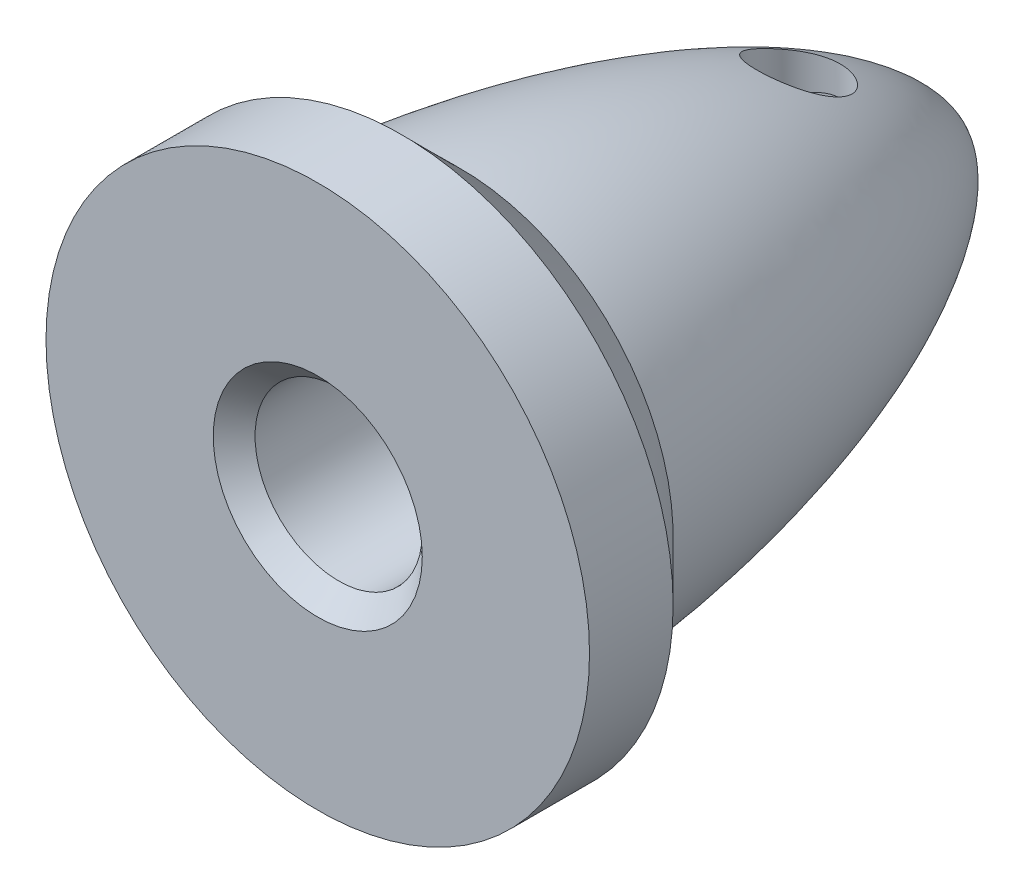
ISO-10303-21;
HEADER;
FILE_DESCRIPTION(('STEP AP214'),'2;1');
FILE_NAME('part.step','',(''),(''),'','','');
FILE_SCHEMA(('AUTOMOTIVE_DESIGN { 1 0 10303 214 1 1 1 1 }'));
ENDSEC;
DATA;
#1=APPLICATION_CONTEXT('core data for automotive mechanical design processes');
#2=APPLICATION_PROTOCOL_DEFINITION('international standard','automotive_design',2000,#1);
#3=PRODUCT_CONTEXT('',#1,'mechanical');
#4=PRODUCT('Part','Part','',(#3));
#5=PRODUCT_RELATED_PRODUCT_CATEGORY('part','',(#4));
#6=PRODUCT_DEFINITION_FORMATION('','',#4);
#7=PRODUCT_DEFINITION_CONTEXT('part definition',#1,'design');
#8=PRODUCT_DEFINITION('design','',#6,#7);
#9=PRODUCT_DEFINITION_SHAPE('','',#8);
#10=(LENGTH_UNIT() NAMED_UNIT(*) SI_UNIT(.MILLI.,.METRE.));
#11=(NAMED_UNIT(*) PLANE_ANGLE_UNIT() SI_UNIT($,.RADIAN.));
#12=(NAMED_UNIT(*) SI_UNIT($,.STERADIAN.) SOLID_ANGLE_UNIT());
#13=UNCERTAINTY_MEASURE_WITH_UNIT(LENGTH_MEASURE(1.E-05),#10,'distance_accuracy_value','');
#14=(GEOMETRIC_REPRESENTATION_CONTEXT(3) GLOBAL_UNCERTAINTY_ASSIGNED_CONTEXT((#13)) GLOBAL_UNIT_ASSIGNED_CONTEXT((#10,
#11,#12)) REPRESENTATION_CONTEXT('',''));
#15=CARTESIAN_POINT('',(0.,0.,0.));
#16=DIRECTION('',(0.,0.,1.));
#17=DIRECTION('',(1.,0.,0.));
#18=AXIS2_PLACEMENT_3D('',#15,#16,#17);
#19=CARTESIAN_POINT('',(0.,-5.,-3.9));
#20=DIRECTION('',(0.,1.,0.));
#21=DIRECTION('',(0.,0.,1.));
#22=AXIS2_PLACEMENT_3D('',#19,#20,#21);
#23=CYLINDRICAL_SURFACE('',#22,0.997568670242186);
#24=CARTESIAN_POINT('',(0.,-2.,-2.90243132975781));
#25=CARTESIAN_POINT('',(0.0524594250103676,-1.99999715271156,-2.90243461416244));
#26=CARTESIAN_POINT('',(0.104981846497094,-1.99791384646165,-2.90659369377345));
#27=CARTESIAN_POINT('',(0.20847533307653,-1.98978531965486,-2.92304653254191));
#28=CARTESIAN_POINT('',(0.259443237930466,-1.98373252693781,-2.93535583943934));
#29=CARTESIAN_POINT('',(0.358172416511937,-1.9682987149076,-2.96750843734887));
#30=CARTESIAN_POINT('',(0.4059452962657,-1.95893061813594,-2.98732249677558));
#31=CARTESIAN_POINT('',(0.497418221518089,-1.93772619949191,-3.03377127700513));
#32=CARTESIAN_POINT('',(0.541118600651973,-1.92589008006731,-3.06040543840724));
#33=CARTESIAN_POINT('',(0.626169972808149,-1.9000012103805,-3.12156495196883));
#34=CARTESIAN_POINT('',(0.667220478988625,-1.88585784272592,-3.15646924980397));
#35=CARTESIAN_POINT('',(0.743161532277854,-1.85724549371793,-3.23236258377246));
#36=CARTESIAN_POINT('',(0.778047409811758,-1.84277627481291,-3.27335618953303));
#37=CARTESIAN_POINT('',(0.843364564321497,-1.81386566917252,-3.36405479673393));
#38=CARTESIAN_POINT('',(0.873245243101548,-1.7995123870187,-3.41418770866831));
#39=CARTESIAN_POINT('',(0.924024628192724,-1.77397624500991,-3.51955942659967));
#40=CARTESIAN_POINT('',(0.944929727889453,-1.76279113037973,-3.57479456404264));
#41=CARTESIAN_POINT('',(0.975808453079659,-1.74587891368218,-3.68543636286623));
#42=CARTESIAN_POINT('',(0.986360516261811,-1.7398656686493,-3.74063565135518));
#43=CARTESIAN_POINT('',(0.998004945436978,-1.73321562954956,-3.85232151391752));
#44=CARTESIAN_POINT('',(0.999106577763639,-1.7325735689459,-3.9088067725558));
#45=CARTESIAN_POINT('',(0.992243397125365,-1.73650805246481,-4.01424319624312));
#46=CARTESIAN_POINT('',(0.985340655259159,-1.74047338582849,-4.0632918589373));
#47=CARTESIAN_POINT('',(0.964503786092984,-1.75210541211421,-4.159413313155));
#48=CARTESIAN_POINT('',(0.950567437155512,-1.75977327448518,-4.20648547528862));
#49=CARTESIAN_POINT('',(0.915804095219781,-1.77811555449783,-4.29866110208399));
#50=CARTESIAN_POINT('',(0.894824107709973,-1.78885586564109,-4.3436931354802));
#51=CARTESIAN_POINT('',(0.846686198043406,-1.81213592195457,-4.42981334345203));
#52=CARTESIAN_POINT('',(0.819525501862759,-1.82467647417265,-4.47089973533549));
#53=CARTESIAN_POINT('',(0.755802970435087,-1.85205530562868,-4.55341692222674));
#54=CARTESIAN_POINT('',(0.718487540091775,-1.86698391849506,-4.59423782550359));
#55=CARTESIAN_POINT('',(0.637478055024337,-1.89617397171442,-4.66929567711961));
#56=CARTESIAN_POINT('',(0.593780997297962,-1.91043509377116,-4.70352950810638));
#57=CARTESIAN_POINT('',(0.49870089967466,-1.93748485064028,-4.76592027816102));
#58=CARTESIAN_POINT('',(0.447056752108998,-1.95017556275888,-4.79372520249353));
#59=CARTESIAN_POINT('',(0.339030490902014,-1.97182225232422,-4.84002501618078));
#60=CARTESIAN_POINT('',(0.282652163496134,-1.98078118077765,-4.85852726427945));
#61=CARTESIAN_POINT('',(0.171748595746771,-1.99332786831197,-4.88418136876396));
#62=CARTESIAN_POINT('',(0.117454606675548,-1.99729798419788,-4.89214415348592));
#63=CARTESIAN_POINT('',(0.00816387715475017,-2.00072902939577,-4.89903464496295));
#64=CARTESIAN_POINT('',(-0.0468325206336346,-2.00019207938678,-4.89796660093067));
#65=CARTESIAN_POINT('',(-0.151461840832209,-1.99489189545261,-4.88729648041862));
#66=CARTESIAN_POINT('',(-0.201181530258334,-1.990457472657,-4.8783582680615));
#67=CARTESIAN_POINT('',(-0.298315888898359,-1.97823278089969,-4.85324089736304));
#68=CARTESIAN_POINT('',(-0.345730302797626,-1.97044214116707,-4.83706093899754));
#69=CARTESIAN_POINT('',(-0.438483036742815,-1.95193103576922,-4.79749202010232));
#70=CARTESIAN_POINT('',(-0.483722743876432,-1.9411329145026,-4.77390952220291));
#71=CARTESIAN_POINT('',(-0.569752888069975,-1.91764786388476,-4.72042282494501));
#72=CARTESIAN_POINT('',(-0.610541414463013,-1.90496012890077,-4.69051592689709));
#73=CARTESIAN_POINT('',(-0.690742536895142,-1.87745650897909,-4.62185218432758));
#74=CARTESIAN_POINT('',(-0.729630098196528,-1.86255385973273,-4.58251576298063));
#75=CARTESIAN_POINT('',(-0.800487709667603,-1.83321933465918,-4.4978406344844));
#76=CARTESIAN_POINT('',(-0.832453032018503,-1.81878778626663,-4.45249785890946));
#77=CARTESIAN_POINT('',(-0.889994104757553,-1.79136155315756,-4.35435650022342));
#78=CARTESIAN_POINT('',(-0.915191481843803,-1.7784684992907,-4.30130515822179));
#79=CARTESIAN_POINT('',(-0.956030922960774,-1.75685704463733,-4.19086515614207));
#80=CARTESIAN_POINT('',(-0.97168524068135,-1.74813329341502,-4.1334821649987));
#81=CARTESIAN_POINT('',(-0.991555618527273,-1.73693290429999,-4.02189201951826));
#82=CARTESIAN_POINT('',(-0.996724150137182,-1.73393766331855,-3.96790759050887));
#83=CARTESIAN_POINT('',(-0.998220994385258,-1.73307746049196,-3.85978501959308));
#84=CARTESIAN_POINT('',(-0.994553077252192,-1.73521031065431,-3.80564695308354));
#85=CARTESIAN_POINT('',(-0.979370449400182,-1.74381655561492,-3.70413991368175));
#86=CARTESIAN_POINT('',(-0.968628985561215,-1.74986129447821,-3.65661431079531));
#87=CARTESIAN_POINT('',(-0.940556813272735,-1.76510806310184,-3.56409077830567));
#88=CARTESIAN_POINT('',(-0.923223993230456,-1.77431110455697,-3.51909366403131));
#89=CARTESIAN_POINT('',(-0.881156555592799,-1.79559265748582,-3.42955779244733));
#90=CARTESIAN_POINT('',(-0.856002764265179,-1.80782285567664,-3.38525309444835));
#91=CARTESIAN_POINT('',(-0.799471838366293,-1.83352357657163,-3.30120442768342));
#92=CARTESIAN_POINT('',(-0.768091474771697,-1.84699474087539,-3.26146284224358));
#93=CARTESIAN_POINT('',(-0.695555903638532,-1.87560589844456,-3.18268087479494));
#94=CARTESIAN_POINT('',(-0.653678039863141,-1.89075106694038,-3.14430408929242));
#95=CARTESIAN_POINT('',(-0.563652567139212,-1.91951220435717,-3.07497480960564));
#96=CARTESIAN_POINT('',(-0.515501619327505,-1.93312735168141,-3.04402629424739));
#97=CARTESIAN_POINT('',(-0.41367088241952,-1.9574559681332,-2.99041101703909));
#98=CARTESIAN_POINT('',(-0.359957002690006,-1.96814988328437,-2.96779972651099));
#99=CARTESIAN_POINT('',(-0.248865292955901,-1.98524556090505,-2.93222434836852));
#100=CARTESIAN_POINT('',(-0.191498408012464,-1.99165954001506,-2.91923279046701));
#101=CARTESIAN_POINT('',(-0.111288392085542,-1.99702534810346,-2.90840654931715));
#102=CARTESIAN_POINT('',(-0.0891086000571398,-1.99813795766139,-2.90616898337109));
#103=CARTESIAN_POINT('',(-0.0446230080425255,-1.99962589942108,-2.90318065446548));
#104=CARTESIAN_POINT('',(-0.0223172045980532,-2.00000121128889,-2.90242993251166));
#105=CARTESIAN_POINT('',(0.,-2.,-2.90243132975781));
#106=B_SPLINE_CURVE_WITH_KNOTS('',3,(#24,#25,#26,#27,#28,#29,#30,#31,#32,#33,#34,#35,#36,#37,
#38,#39,#40,#41,#42,#43,#44,#45,#46,#47,#48,#49,#50,#51,#52,#53,#54,#55,#56,#57,#58,#59,#60,#61,
#62,#63,#64,#65,#66,#67,#68,#69,#70,#71,#72,#73,#74,#75,#76,#77,#78,#79,#80,#81,#82,#83,#84,#85,
#86,#87,#88,#89,#90,#91,#92,#93,#94,#95,#96,#97,#98,#99,#100,#101,#102,#103,#104,#105),
.UNSPECIFIED.,.T.,.F.,(4,2,2,2,2,2,2,2,2,2,2,2,2,2,2,2,2,2,2,2,2,2,2,2,2,2,2,2,2,2,2,2,2,2,2,2,
2,2,2,2,4),(0.,0.157287695322589,0.314876307548981,0.471857309339841,0.628825439303562,
0.795257106534248,0.961814306785799,1.14120921429041,1.32047612433182,1.4890336514275,
1.65742588563349,1.80580307736868,1.95422716493226,2.10610973372331,2.25806060532531,
2.42917244572679,2.60036506723189,2.77943327147504,2.9583596027345,3.12251476479556,
3.28659269237707,3.43802886338051,3.58948176826449,3.74528055828942,3.90114596396449,
4.07226055446166,4.24349164844425,4.4229060679713,4.60208962390087,4.76409983349614,
4.92604093078355,5.07269813692586,5.2194023654903,5.37596642495026,5.5326118897992,
5.70816425474045,5.88381044250717,6.06060505174886,6.2368928351642,6.30380406936197,
6.37071714888156),.UNSPECIFIED.);
#107=CARTESIAN_POINT('',(0.,-2.,-2.90243132975781));
#108=VERTEX_POINT('',#107);
#109=EDGE_CURVE('E101',#108,#108,#106,.T.);
#110=ORIENTED_EDGE('',*,*,#109,.T.);
#111=EDGE_LOOP('',(#110));
#112=FACE_BOUND('',#111,.T.);
#113=CARTESIAN_POINT('',(1.06468653338077E-13,-3.58282475890323,-2.90243132975764));
#114=CARTESIAN_POINT('',(-0.0499231173740659,-3.58282389738684,-2.90243245712086));
#115=CARTESIAN_POINT('',(-0.0998554337525465,-3.580397203753,-2.90619925757935));
#116=CARTESIAN_POINT('',(-0.198163222545221,-3.57086699546815,-2.92104685749568));
#117=CARTESIAN_POINT('',(-0.246537987235049,-3.56376138539764,-2.93213093394929));
#118=CARTESIAN_POINT('',(-0.340158759188664,-3.54540219146496,-2.96094484845661));
#119=CARTESIAN_POINT('',(-0.385418011384299,-3.53416764454145,-2.97864419231534));
#120=CARTESIAN_POINT('',(-0.472146430271123,-3.50818427726644,-3.01992408523352));
#121=CARTESIAN_POINT('',(-0.513608951743976,-3.49342945231644,-3.04351468635832));
#122=CARTESIAN_POINT('',(-0.59464742281207,-3.4600474068558,-3.0974642714262));
#123=CARTESIAN_POINT('',(-0.633911013826299,-3.44122701278957,-3.12817075784944));
#124=CARTESIAN_POINT('',(-0.706828013724319,-3.40125119064826,-3.19433410854948));
#125=CARTESIAN_POINT('',(-0.740479127150034,-3.38009481302547,-3.22979290584195));
#126=CARTESIAN_POINT('',(-0.806596675956152,-3.33284477365775,-3.31037203075725));
#127=CARTESIAN_POINT('',(-0.838089406126025,-3.30649159027203,-3.35614002442536));
#128=CARTESIAN_POINT('',(-0.892912382817367,-3.25275722329869,-3.45178849715272));
#129=CARTESIAN_POINT('',(-0.916237390972063,-3.22537539240607,-3.5016715901864));
#130=CARTESIAN_POINT('',(-0.956617787861717,-3.16736469538357,-3.61055898432707));
#131=CARTESIAN_POINT('',(-0.972629961853218,-3.13672817610381,-3.66994968119578));
#132=CARTESIAN_POINT('',(-0.993535409728305,-3.07665909597668,-3.79127791884639));
#133=CARTESIAN_POINT('',(-0.998425835420053,-3.04722684542763,-3.85321610788733));
#134=CARTESIAN_POINT('',(-0.996460473664671,-2.99062673503494,-3.97843408769578));
#135=CARTESIAN_POINT('',(-0.989533335491946,-2.96347367583267,-4.04171973342983));
#136=CARTESIAN_POINT('',(-0.963256350802135,-2.9128078572598,-4.16716345791828));
#137=CARTESIAN_POINT('',(-0.9439173038151,-2.88929195527253,-4.22932246865287));
#138=CARTESIAN_POINT('',(-0.895232016751631,-2.84882209827897,-4.34407458721339));
#139=CARTESIAN_POINT('',(-0.867040334153196,-2.83145262006946,-4.39701038836146));
#140=CARTESIAN_POINT('',(-0.800941100070784,-2.80065601487977,-4.49770918775916));
#141=CARTESIAN_POINT('',(-0.763039350585314,-2.7872265438946,-4.5454752508909));
#142=CARTESIAN_POINT('',(-0.682558280911839,-2.76524243601699,-4.62960733176164));
#143=CARTESIAN_POINT('',(-0.640745145595051,-2.75634991204458,-4.66662114089325));
#144=CARTESIAN_POINT('',(-0.551202054372667,-2.74132394769611,-4.73332725840126));
#145=CARTESIAN_POINT('',(-0.503472895288707,-2.7351901362666,-4.76302055116178));
#146=CARTESIAN_POINT('',(-0.404843998141331,-2.72534660922652,-4.81336215646564));
#147=CARTESIAN_POINT('',(-0.354061208343609,-2.72157718001246,-4.83422853473058));
#148=CARTESIAN_POINT('',(-0.249671158864457,-2.71580342760696,-4.86737085425217));
#149=CARTESIAN_POINT('',(-0.196063889569409,-2.71379911042381,-4.8796467662676));
#150=CARTESIAN_POINT('',(-0.0871986642467561,-2.7112738895278,-4.8952799274579));
#151=CARTESIAN_POINT('',(-0.0319326759746479,-2.7107620454948,-4.8985826992373));
#152=CARTESIAN_POINT('',(0.0783823673109298,-2.71116819175905,-4.89601385986357));
#153=CARTESIAN_POINT('',(0.133431413428654,-2.71208624009005,-4.89014187634286));
#154=CARTESIAN_POINT('',(0.241972141754791,-2.71549844250584,-4.86935939246573));
#155=CARTESIAN_POINT('',(0.295456869893833,-2.71799876341883,-4.85441353644796));
#156=CARTESIAN_POINT('',(0.39910494524898,-2.72491162969959,-4.81592250084443));
#157=CARTESIAN_POINT('',(0.449268469444906,-2.72932407307978,-4.79237777991009));
#158=CARTESIAN_POINT('',(0.544610709514551,-2.74047553100574,-4.73758674264088));
#159=CARTESIAN_POINT('',(0.589810800477652,-2.74720400789032,-4.70637548916394));
#160=CARTESIAN_POINT('',(0.674201221991998,-2.76341324285525,-4.63727169027225));
#161=CARTESIAN_POINT('',(0.713392388812106,-2.77289361741855,-4.59938007615184));
#162=CARTESIAN_POINT('',(0.784548069031865,-2.79482689410507,-4.51847707779455));
#163=CARTESIAN_POINT('',(0.816551860057461,-2.80726283580421,-4.47549558310297));
#164=CARTESIAN_POINT('',(0.872948868144541,-2.83518084631849,-4.38571141700376));
#165=CARTESIAN_POINT('',(0.897341370867181,-2.85066320082503,-4.3389083874551));
#166=CARTESIAN_POINT('',(0.938743821936914,-2.88490392425152,-4.24171061673953));
#167=CARTESIAN_POINT('',(0.955546849644156,-2.90373657003319,-4.19125433425663));
#168=CARTESIAN_POINT('',(0.980853712563348,-2.94394083460608,-4.08929313708715));
#169=CARTESIAN_POINT('',(0.989354615113955,-2.96531334759756,-4.0377878584046));
#170=CARTESIAN_POINT('',(0.998663471474733,-3.01186011672667,-3.93066232319129));
#171=CARTESIAN_POINT('',(0.998774521715492,-3.03720267744581,-3.87505525867204));
#172=CARTESIAN_POINT('',(0.989960873197463,-3.08933426106788,-3.76524332672793));
#173=CARTESIAN_POINT('',(0.981030428832837,-3.11612419348584,-3.71103937340165));
#174=CARTESIAN_POINT('',(0.953164973066095,-3.17307143994346,-3.59958038105514));
#175=CARTESIAN_POINT('',(0.933290247250398,-3.20329032239285,-3.54259010770034));
#176=CARTESIAN_POINT('',(0.883473915900581,-3.26319723477082,-3.4328245505961));
#177=CARTESIAN_POINT('',(0.853524746444596,-3.29288484812992,-3.38005247083276));
#178=CARTESIAN_POINT('',(0.782724332203025,-3.35140046227825,-3.2783404878894));
#179=CARTESIAN_POINT('',(0.741524970925017,-3.38016092581745,-3.22960212932498));
#180=CARTESIAN_POINT('',(0.649328290158312,-3.43396516400959,-3.13997826335203));
#181=CARTESIAN_POINT('',(0.59834590201953,-3.45901450083061,-3.09908097626721));
#182=CARTESIAN_POINT('',(0.501470902634161,-3.49797709898698,-3.03621375038132));
#183=CARTESIAN_POINT('',(0.457474058863277,-3.51311001632547,-3.0120667283537));
#184=CARTESIAN_POINT('',(0.36536672867193,-3.53940026612119,-2.97037830271318));
#185=CARTESIAN_POINT('',(0.317261447741135,-3.55056253946485,-2.95282868803388));
#186=CARTESIAN_POINT('',(0.224593815704602,-3.56704008909386,-2.92701238952466));
#187=CARTESIAN_POINT('',(0.180386528710261,-3.57292770589227,-2.91783411336455));
#188=CARTESIAN_POINT('',(0.0907886489830712,-3.58082031509142,-2.90554325433268));
#189=CARTESIAN_POINT('',(0.04539812799074,-3.5828255423325,-2.90243030457767));
#190=CARTESIAN_POINT('',(1.06468653338077E-13,-3.58282475890323,-2.90243132975764));
#191=B_SPLINE_CURVE_WITH_KNOTS('',3,(#113,#114,#115,#116,#117,#118,#119,#120,#121,#122,#123,
#124,#125,#126,#127,#128,#129,#130,#131,#132,#133,#134,#135,#136,#137,#138,#139,#140,#141,#142,
#143,#144,#145,#146,#147,#148,#149,#150,#151,#152,#153,#154,#155,#156,#157,#158,#159,#160,#161,
#162,#163,#164,#165,#166,#167,#168,#169,#170,#171,#172,#173,#174,#175,#176,#177,#178,#179,#180,
#181,#182,#183,#184,#185,#186,#187,#188,#189,#190),.UNSPECIFIED.,.T.,.F.,(4,2,2,2,2,2,2,2,2,2,2,
2,2,2,2,2,2,2,2,2,2,2,2,2,2,2,2,2,2,2,2,2,2,2,2,2,2,2,4),(0.,0.149590891646238,
0.299248822115795,0.448225220908287,0.597457571260476,0.756685140237273,0.915977673153277,
1.09970723634143,1.28355441955071,1.48876056338211,1.69401925297021,1.90052162035303,
2.10684455436017,2.29312569795927,2.47929579265137,2.6480988007921,2.81687909772814,
2.98120419793327,3.14552985748415,3.31085095870883,3.47617876984724,3.6421549400653,
3.80812225863944,3.97334421551919,4.13854315735717,4.30281607480959,4.46710440506084,
4.63563544467671,4.80422599506598,4.9868063409,5.1695027840828,5.37110622319253,
5.57286136585846,5.78175207349479,5.99032646156697,6.14694360967845,6.30336518321045,
6.43940551136134,6.57543761036448),.UNSPECIFIED.);
#192=CARTESIAN_POINT('',(1.06468653338077E-13,-3.58282475890323,-2.90243132975764));
#193=VERTEX_POINT('',#192);
#194=EDGE_CURVE('E87',#193,#193,#191,.T.);
#195=ORIENTED_EDGE('',*,*,#194,.T.);
#196=EDGE_LOOP('',(#195));
#197=FACE_BOUND('',#196,.T.);
#198=ADVANCED_FACE('F40',(#112,#197),#23,.F.);
#199=CARTESIAN_POINT('',(0.,0.,-7.6));
#200=CARTESIAN_POINT('',(-1.97174268393665,0.,-7.41138074985025));
#201=CARTESIAN_POINT('',(-4.45743913995399,0.,-2.68629920780597));
#202=CARTESIAN_POINT('',(-5.0857864376269,0.,4.18578643762691));
#203=B_SPLINE_CURVE_WITH_KNOTS('',3,(#199,#200,#201,#202),.UNSPECIFIED.,.F.,.F.,(4,4),(0.,1.),.UNSPECIFIED.);
#204=CARTESIAN_POINT('',(0.,0.,-14.3448275862069));
#205=DIRECTION('',(0.,0.,-1.));
#206=AXIS1_PLACEMENT('',#204,#205);
#207=SURFACE_OF_REVOLUTION('',#203,#206);
#208=ORIENTED_EDGE('',*,*,#194,.F.);
#209=EDGE_LOOP('',(#208));
#210=FACE_BOUND('',#209,.T.);
#211=CARTESIAN_POINT('',(0.,3.58282475890321,-2.90243132975766));
#212=CARTESIAN_POINT('',(0.0499231173742492,3.58282389738681,-2.90243245712089));
#213=CARTESIAN_POINT('',(0.0998554337527351,3.58039720375298,-2.90619925757937));
#214=CARTESIAN_POINT('',(0.198163222545414,3.57086699546813,-2.92104685749571));
#215=CARTESIAN_POINT('',(0.246537987235242,3.56376138539761,-2.93213093394934));
#216=CARTESIAN_POINT('',(0.340158759188858,3.54540219146492,-2.96094484845669));
#217=CARTESIAN_POINT('',(0.385418011384493,3.5341676445414,-2.97864419231542));
#218=CARTESIAN_POINT('',(0.472146430271314,3.50818427726637,-3.01992408523362));
#219=CARTESIAN_POINT('',(0.513608951744164,3.49342945231637,-3.04351468635843));
#220=CARTESIAN_POINT('',(0.594647422812251,3.46004740685572,-3.09746427142633));
#221=CARTESIAN_POINT('',(0.633911013826476,3.44122701278949,-3.12817075784959));
#222=CARTESIAN_POINT('',(0.706828013724486,3.40125119064816,-3.19433410854965));
#223=CARTESIAN_POINT('',(0.740479127150196,3.38009481302536,-3.22979290584213));
#224=CARTESIAN_POINT('',(0.8065966759563,3.33284477365763,-3.31037203075745));
#225=CARTESIAN_POINT('',(0.838089406126164,3.30649159027191,-3.35614002442557));
#226=CARTESIAN_POINT('',(0.892912382817485,3.25275722329856,-3.45178849715295));
#227=CARTESIAN_POINT('',(0.916237390972171,3.22537539240594,-3.50167159018665));
#228=CARTESIAN_POINT('',(0.956617787861799,3.16736469538343,-3.61055898432734));
#229=CARTESIAN_POINT('',(0.972629961853283,3.13672817610367,-3.66994968119605));
#230=CARTESIAN_POINT('',(0.993535409728337,3.07665909597654,-3.79127791884668));
#231=CARTESIAN_POINT('',(0.998425835420069,3.04722684542749,-3.85321610788762));
#232=CARTESIAN_POINT('',(0.99646047366465,2.99062673503481,-3.97843408769607));
#233=CARTESIAN_POINT('',(0.989533335491905,2.96347367583255,-4.04171973343013));
#234=CARTESIAN_POINT('',(0.963256350802058,2.91280785725969,-4.16716345791857));
#235=CARTESIAN_POINT('',(0.943917303815005,2.88929195527243,-4.22932246865314));
#236=CARTESIAN_POINT('',(0.895232016751504,2.84882209827888,-4.34407458721365));
#237=CARTESIAN_POINT('',(0.867040334153055,2.83145262006938,-4.39701038836171));
#238=CARTESIAN_POINT('',(0.800941100070618,2.80065601487971,-4.49770918775938));
#239=CARTESIAN_POINT('',(0.763039350585138,2.78722654389455,-4.54547525089111));
#240=CARTESIAN_POINT('',(0.682558280911646,2.76524243601694,-4.62960733176182));
#241=CARTESIAN_POINT('',(0.640745145594849,2.75634991204454,-4.66662114089342));
#242=CARTESIAN_POINT('',(0.551202054372451,2.74132394769608,-4.73332725840141));
#243=CARTESIAN_POINT('',(0.503472895288484,2.73519013626657,-4.76302055116191));
#244=CARTESIAN_POINT('',(0.404843998141098,2.7253466092265,-4.81336215646575));
#245=CARTESIAN_POINT('',(0.354061208343371,2.72157718001244,-4.83422853473067));
#246=CARTESIAN_POINT('',(0.24967115886421,2.71580342760695,-4.86737085425223));
#247=CARTESIAN_POINT('',(0.196063889569159,2.7137991104238,-4.87964676626765));
#248=CARTESIAN_POINT('',(0.0871986642465013,2.71127388952779,-4.89527992745792));
#249=CARTESIAN_POINT('',(0.0319326759743918,2.7107620454948,-4.89858269923731));
#250=CARTESIAN_POINT('',(-0.078382367311186,2.71116819175905,-4.89601385986355));
#251=CARTESIAN_POINT('',(-0.133431413428909,2.71208624009005,-4.89014187634282));
#252=CARTESIAN_POINT('',(-0.241972141755041,2.71549844250585,-4.86935939246566));
#253=CARTESIAN_POINT('',(-0.295456869894079,2.71799876341884,-4.85441353644788));
#254=CARTESIAN_POINT('',(-0.399104945249214,2.72491162969961,-4.81592250084433));
#255=CARTESIAN_POINT('',(-0.449268469445134,2.7293240730798,-4.79237777990997));
#256=CARTESIAN_POINT('',(-0.544610709514764,2.74047553100577,-4.73758674264074));
#257=CARTESIAN_POINT('',(-0.589810800477857,2.74720400789035,-4.70637548916379));
#258=CARTESIAN_POINT('',(-0.674201221992184,2.76341324285529,-4.63727169027208));
#259=CARTESIAN_POINT('',(-0.713392388812281,2.7728936174186,-4.59938007615166));
#260=CARTESIAN_POINT('',(-0.784548069032019,2.79482689410512,-4.51847707779435));
#261=CARTESIAN_POINT('',(-0.816551860057603,2.80726283580427,-4.47549558310276));
#262=CARTESIAN_POINT('',(-0.872948868144659,2.83518084631856,-4.38571141700354));
#263=CARTESIAN_POINT('',(-0.897341370867286,2.8506632008251,-4.33890838745488));
#264=CARTESIAN_POINT('',(-0.938743821936996,2.88490392425161,-4.2417106167393));
#265=CARTESIAN_POINT('',(-0.955546849644226,2.90373657003327,-4.1912543342564));
#266=CARTESIAN_POINT('',(-0.980853712563394,2.94394083460618,-4.0892931370869));
#267=CARTESIAN_POINT('',(-0.989354615113988,2.96531334759766,-4.03778785840435));
#268=CARTESIAN_POINT('',(-0.99866347147474,3.01186011672678,-3.93066232319104));
#269=CARTESIAN_POINT('',(-0.998774521715485,3.03720267744592,-3.87505525867179));
#270=CARTESIAN_POINT('',(-0.989960873197428,3.08933426106801,-3.76524332672767));
#271=CARTESIAN_POINT('',(-0.981030428832787,3.11612419348597,-3.71103937340139));
#272=CARTESIAN_POINT('',(-0.953164973066013,3.17307143994359,-3.59958038105488));
#273=CARTESIAN_POINT('',(-0.9332902472503,3.20329032239299,-3.54259010770008));
#274=CARTESIAN_POINT('',(-0.883473915900448,3.26319723477096,-3.43282455059585));
#275=CARTESIAN_POINT('',(-0.853524746444446,3.29288484813006,-3.38005247083252));
#276=CARTESIAN_POINT('',(-0.782724332202842,3.35140046227838,-3.27834048788917));
#277=CARTESIAN_POINT('',(-0.74152497092482,3.38016092581758,-3.22960212932476));
#278=CARTESIAN_POINT('',(-0.649328290158087,3.43396516400971,-3.13997826335184));
#279=CARTESIAN_POINT('',(-0.598345902019293,3.45901450083072,-3.09908097626703));
#280=CARTESIAN_POINT('',(-0.501470902633907,3.49797709898707,-3.03621375038117));
#281=CARTESIAN_POINT('',(-0.457474058863018,3.51311001632556,-3.01206672835357));
#282=CARTESIAN_POINT('',(-0.365366728671666,3.53940026612125,-2.97037830271308));
#283=CARTESIAN_POINT('',(-0.317261447740871,3.5505625394649,-2.9528286880338));
#284=CARTESIAN_POINT('',(-0.224593815704352,3.5670400890939,-2.9270123895246));
#285=CARTESIAN_POINT('',(-0.180386528710025,3.57292770589231,-2.9178341133645));
#286=CARTESIAN_POINT('',(-0.0907886489828642,3.58082031509142,-2.90554325433266));
#287=CARTESIAN_POINT('',(-0.0453981279905476,3.58282554233248,-2.90243030457769));
#288=CARTESIAN_POINT('',(0.,3.58282475890321,-2.90243132975766));
#289=B_SPLINE_CURVE_WITH_KNOTS('',3,(#211,#212,#213,#214,#215,#216,#217,#218,#219,#220,#221,
#222,#223,#224,#225,#226,#227,#228,#229,#230,#231,#232,#233,#234,#235,#236,#237,#238,#239,#240,
#241,#242,#243,#244,#245,#246,#247,#248,#249,#250,#251,#252,#253,#254,#255,#256,#257,#258,#259,
#260,#261,#262,#263,#264,#265,#266,#267,#268,#269,#270,#271,#272,#273,#274,#275,#276,#277,#278,
#279,#280,#281,#282,#283,#284,#285,#286,#287,#288),.UNSPECIFIED.,.T.,.F.,(4,2,2,2,2,2,2,2,2,2,2,
2,2,2,2,2,2,2,2,2,2,2,2,2,2,2,2,2,2,2,2,2,2,2,2,2,2,2,4),(0.,0.149590891646253,0.29924882211582,
0.448225220908328,0.59745757126053,0.756685140237343,0.915977673153364,1.09970723634153,
1.28355441955083,1.48876056338225,1.69401925297036,1.90052162035317,2.1068445543603,
2.29312569795938,2.47929579265146,2.64809880079219,2.81687909772822,2.98120419793335,
3.14552985748423,3.31085095870891,3.47617876984732,3.64215494006538,3.80812225863952,
3.97334421551927,4.13854315735725,4.30281607480966,4.46710440506091,4.63563544467679,
4.80422599506607,4.98680634090011,5.16950278408291,5.37110622319266,5.5728613658586,
5.78175207349493,5.9903264615671,6.14694360967856,6.30336518321054,6.43940551136138,
6.57543761036448),.UNSPECIFIED.);
#290=CARTESIAN_POINT('',(0.,3.58282475890321,-2.90243132975766));
#291=VERTEX_POINT('',#290);
#292=EDGE_CURVE('E94',#291,#291,#289,.T.);
#293=ORIENTED_EDGE('',*,*,#292,.F.);
#294=EDGE_LOOP('',(#293));
#295=FACE_BOUND('',#294,.T.);
#296=CARTESIAN_POINT('',(0.,0.,4.18578643762691));
#297=DIRECTION('',(0.,0.,-1.));
#298=DIRECTION('',(-1.,0.,0.));
#299=AXIS2_PLACEMENT_3D('',#296,#297,#298);
#300=CIRCLE('',#299,5.0857864376269);
#301=CARTESIAN_POINT('',(-5.0857864376269,0.,4.18578643762691));
#302=VERTEX_POINT('',#301);
#303=EDGE_CURVE('E91',#302,#302,#300,.T.);
#304=ORIENTED_EDGE('',*,*,#303,.T.);
#305=EDGE_LOOP('',(#304));
#306=FACE_BOUND('',#305,.T.);
#307=CARTESIAN_POINT('',(0.,0.,-7.6));
#308=VERTEX_POINT('',#307);
#309=VERTEX_LOOP('',#308);
#310=FACE_BOUND('',#309,.T.);
#311=ADVANCED_FACE('F52',(#210,#295,#306,#310),#207,.F.);
#312=CARTESIAN_POINT('',(0.,0.,4.18578643762691));
#313=DIRECTION('',(0.,0.,1.));
#314=DIRECTION('',(1.,0.,0.));
#315=AXIS2_PLACEMENT_3D('',#312,#313,#314);
#316=CONICAL_SURFACE('',#315,5.0857864376269,0.78539816339745);
#317=CARTESIAN_POINT('',(0.,0.,5.6));
#318=DIRECTION('',(0.,0.,-1.));
#319=DIRECTION('',(-1.,0.,0.));
#320=AXIS2_PLACEMENT_3D('',#317,#318,#319);
#321=CIRCLE('',#320,6.5);
#322=CARTESIAN_POINT('',(-6.5,0.,5.6));
#323=VERTEX_POINT('',#322);
#324=EDGE_CURVE('E86',#323,#323,#321,.T.);
#325=ORIENTED_EDGE('',*,*,#324,.T.);
#326=EDGE_LOOP('',(#325));
#327=FACE_BOUND('',#326,.T.);
#328=ORIENTED_EDGE('',*,*,#303,.F.);
#329=EDGE_LOOP('',(#328));
#330=FACE_BOUND('',#329,.T.);
#331=ADVANCED_FACE('F54',(#327,#330),#316,.T.);
#332=CARTESIAN_POINT('',(0.,0.,-14.3448275862069));
#333=DIRECTION('',(0.,0.,-1.));
#334=DIRECTION('',(-1.,0.,0.));
#335=AXIS2_PLACEMENT_3D('',#332,#333,#334);
#336=CYLINDRICAL_SURFACE('',#335,6.5);
#337=CARTESIAN_POINT('',(0.,0.,7.6));
#338=DIRECTION('',(0.,0.,-1.));
#339=DIRECTION('',(-1.,0.,0.));
#340=AXIS2_PLACEMENT_3D('',#337,#338,#339);
#341=CIRCLE('',#340,6.5);
#342=CARTESIAN_POINT('',(-6.5,0.,7.6));
#343=VERTEX_POINT('',#342);
#344=EDGE_CURVE('E79',#343,#343,#341,.T.);
#345=ORIENTED_EDGE('',*,*,#344,.T.);
#346=EDGE_LOOP('',(#345));
#347=FACE_BOUND('',#346,.T.);
#348=ORIENTED_EDGE('',*,*,#324,.F.);
#349=EDGE_LOOP('',(#348));
#350=FACE_BOUND('',#349,.T.);
#351=ADVANCED_FACE('F60',(#347,#350),#336,.T.);
#352=CARTESIAN_POINT('',(0.,0.,7.6));
#353=DIRECTION('',(0.,0.,1.));
#354=DIRECTION('',(1.,0.,0.));
#355=AXIS2_PLACEMENT_3D('',#352,#353,#354);
#356=PLANE('',#355);
#357=CARTESIAN_POINT('',(0.,0.,7.6));
#358=DIRECTION('',(0.,0.,1.));
#359=DIRECTION('',(1.,0.,0.));
#360=AXIS2_PLACEMENT_3D('',#357,#358,#359);
#361=CIRCLE('',#360,2.49999999999999);
#362=CARTESIAN_POINT('',(2.49999999999999,0.,7.6));
#363=VERTEX_POINT('',#362);
#364=EDGE_CURVE('E11',#363,#363,#361,.F.);
#365=ORIENTED_EDGE('',*,*,#364,.T.);
#366=EDGE_LOOP('',(#365));
#367=FACE_BOUND('',#366,.T.);
#368=ORIENTED_EDGE('',*,*,#344,.F.);
#369=EDGE_LOOP('',(#368));
#370=FACE_BOUND('',#369,.T.);
#371=ADVANCED_FACE('F111',(#367,#370),#356,.T.);
#372=CARTESIAN_POINT('',(0.,2.,-2.90243132975781));
#373=CARTESIAN_POINT('',(-0.0524594250103667,1.99999715271156,-2.90243461416244));
#374=CARTESIAN_POINT('',(-0.104981846497093,1.99791384646165,-2.90659369377345));
#375=CARTESIAN_POINT('',(-0.208475333076529,1.98978531965486,-2.92304653254191));
#376=CARTESIAN_POINT('',(-0.259443237930465,1.98373252693781,-2.93535583943934));
#377=CARTESIAN_POINT('',(-0.358172416511936,1.9682987149076,-2.96750843734887));
#378=CARTESIAN_POINT('',(-0.405945296265699,1.95893061813594,-2.98732249677558));
#379=CARTESIAN_POINT('',(-0.497418221518088,1.93772619949191,-3.03377127700513));
#380=CARTESIAN_POINT('',(-0.541118600651972,1.92589008006731,-3.06040543840724));
#381=CARTESIAN_POINT('',(-0.626169972808148,1.9000012103805,-3.12156495196883));
#382=CARTESIAN_POINT('',(-0.667220478988624,1.88585784272592,-3.15646924980397));
#383=CARTESIAN_POINT('',(-0.743161532277853,1.85724549371793,-3.23236258377246));
#384=CARTESIAN_POINT('',(-0.778047409811757,1.84277627481291,-3.27335618953303));
#385=CARTESIAN_POINT('',(-0.843364564321496,1.81386566917252,-3.36405479673393));
#386=CARTESIAN_POINT('',(-0.873245243101547,1.7995123870187,-3.41418770866831));
#387=CARTESIAN_POINT('',(-0.924024628192723,1.77397624500991,-3.51955942659967));
#388=CARTESIAN_POINT('',(-0.944929727889452,1.76279113037973,-3.57479456404264));
#389=CARTESIAN_POINT('',(-0.975808453079658,1.74587891368218,-3.68543636286623));
#390=CARTESIAN_POINT('',(-0.98636051626181,1.7398656686493,-3.74063565135518));
#391=CARTESIAN_POINT('',(-0.998004945436978,1.73321562954956,-3.85232151391752));
#392=CARTESIAN_POINT('',(-0.999106577763638,1.7325735689459,-3.9088067725558));
#393=CARTESIAN_POINT('',(-0.992243397125364,1.73650805246481,-4.01424319624312));
#394=CARTESIAN_POINT('',(-0.985340655259158,1.74047338582849,-4.0632918589373));
#395=CARTESIAN_POINT('',(-0.964503786092983,1.75210541211421,-4.159413313155));
#396=CARTESIAN_POINT('',(-0.950567437155512,1.75977327448518,-4.20648547528862));
#397=CARTESIAN_POINT('',(-0.91580409521978,1.77811555449783,-4.29866110208399));
#398=CARTESIAN_POINT('',(-0.894824107709972,1.78885586564109,-4.3436931354802));
#399=CARTESIAN_POINT('',(-0.846686198043405,1.81213592195458,-4.42981334345203));
#400=CARTESIAN_POINT('',(-0.819525501862759,1.82467647417265,-4.47089973533549));
#401=CARTESIAN_POINT('',(-0.755802970435086,1.85205530562868,-4.55341692222674));
#402=CARTESIAN_POINT('',(-0.718487540091775,1.86698391849506,-4.59423782550359));
#403=CARTESIAN_POINT('',(-0.637478055024336,1.89617397171442,-4.66929567711961));
#404=CARTESIAN_POINT('',(-0.593780997297961,1.91043509377116,-4.70352950810638));
#405=CARTESIAN_POINT('',(-0.498700899674659,1.93748485064028,-4.76592027816102));
#406=CARTESIAN_POINT('',(-0.447056752108997,1.95017556275888,-4.79372520249353));
#407=CARTESIAN_POINT('',(-0.339030490902013,1.97182225232422,-4.84002501618078));
#408=CARTESIAN_POINT('',(-0.282652163496133,1.98078118077765,-4.85852726427945));
#409=CARTESIAN_POINT('',(-0.17174859574677,1.99332786831197,-4.88418136876396));
#410=CARTESIAN_POINT('',(-0.117454606675547,1.99729798419788,-4.89214415348592));
#411=CARTESIAN_POINT('',(-0.00816387715474905,2.00072902939577,-4.89903464496295));
#412=CARTESIAN_POINT('',(0.0468325206336357,2.00019207938678,-4.89796660093067));
#413=CARTESIAN_POINT('',(0.15146184083221,1.99489189545261,-4.88729648041862));
#414=CARTESIAN_POINT('',(0.201181530258335,1.990457472657,-4.8783582680615));
#415=CARTESIAN_POINT('',(0.29831588889836,1.97823278089969,-4.85324089736304));
#416=CARTESIAN_POINT('',(0.345730302797627,1.97044214116707,-4.83706093899754));
#417=CARTESIAN_POINT('',(0.438483036742816,1.95193103576922,-4.79749202010232));
#418=CARTESIAN_POINT('',(0.483722743876433,1.9411329145026,-4.77390952220291));
#419=CARTESIAN_POINT('',(0.569752888069976,1.91764786388476,-4.72042282494501));
#420=CARTESIAN_POINT('',(0.610541414463014,1.90496012890077,-4.69051592689709));
#421=CARTESIAN_POINT('',(0.690742536895143,1.87745650897909,-4.62185218432758));
#422=CARTESIAN_POINT('',(0.729630098196529,1.86255385973273,-4.58251576298063));
#423=CARTESIAN_POINT('',(0.800487709667604,1.83321933465918,-4.4978406344844));
#424=CARTESIAN_POINT('',(0.832453032018504,1.81878778626662,-4.45249785890946));
#425=CARTESIAN_POINT('',(0.889994104757554,1.79136155315756,-4.35435650022342));
#426=CARTESIAN_POINT('',(0.915191481843804,1.77846849929069,-4.30130515822179));
#427=CARTESIAN_POINT('',(0.956030922960775,1.75685704463733,-4.19086515614207));
#428=CARTESIAN_POINT('',(0.971685240681351,1.74813329341502,-4.1334821649987));
#429=CARTESIAN_POINT('',(0.991555618527274,1.73693290429999,-4.02189201951826));
#430=CARTESIAN_POINT('',(0.996724150137183,1.73393766331855,-3.96790759050887));
#431=CARTESIAN_POINT('',(0.998220994385259,1.73307746049196,-3.85978501959308));
#432=CARTESIAN_POINT('',(0.994553077252193,1.73521031065431,-3.80564695308354));
#433=CARTESIAN_POINT('',(0.979370449400183,1.74381655561492,-3.70413991368175));
#434=CARTESIAN_POINT('',(0.968628985561216,1.74986129447821,-3.65661431079531));
#435=CARTESIAN_POINT('',(0.940556813272736,1.76510806310184,-3.56409077830567));
#436=CARTESIAN_POINT('',(0.923223993230457,1.77431110455697,-3.51909366403131));
#437=CARTESIAN_POINT('',(0.8811565555928,1.79559265748582,-3.42955779244733));
#438=CARTESIAN_POINT('',(0.85600276426518,1.80782285567664,-3.38525309444835));
#439=CARTESIAN_POINT('',(0.799471838366294,1.83352357657163,-3.30120442768342));
#440=CARTESIAN_POINT('',(0.768091474771698,1.84699474087539,-3.26146284224358));
#441=CARTESIAN_POINT('',(0.695555903638533,1.87560589844456,-3.18268087479494));
#442=CARTESIAN_POINT('',(0.653678039863142,1.89075106694038,-3.14430408929242));
#443=CARTESIAN_POINT('',(0.563652567139213,1.91951220435717,-3.07497480960564));
#444=CARTESIAN_POINT('',(0.515501619327506,1.93312735168141,-3.04402629424739));
#445=CARTESIAN_POINT('',(0.413670882419521,1.9574559681332,-2.99041101703909));
#446=CARTESIAN_POINT('',(0.359957002690007,1.96814988328437,-2.96779972651099));
#447=CARTESIAN_POINT('',(0.248865292955902,1.98524556090505,-2.93222434836852));
#448=CARTESIAN_POINT('',(0.191498408012464,1.99165954001506,-2.91923279046701));
#449=CARTESIAN_POINT('',(0.111288392085543,1.99702534810346,-2.90840654931715));
#450=CARTESIAN_POINT('',(0.0891086000571406,1.99813795766139,-2.90616898337109));
#451=CARTESIAN_POINT('',(0.0446230080425263,1.99962589942108,-2.90318065446548));
#452=CARTESIAN_POINT('',(0.022317204598054,2.00000121128889,-2.90242993251166));
#453=CARTESIAN_POINT('',(0.,2.,-2.90243132975781));
#454=B_SPLINE_CURVE_WITH_KNOTS('',3,(#372,#373,#374,#375,#376,#377,#378,#379,#380,#381,#382,
#383,#384,#385,#386,#387,#388,#389,#390,#391,#392,#393,#394,#395,#396,#397,#398,#399,#400,#401,
#402,#403,#404,#405,#406,#407,#408,#409,#410,#411,#412,#413,#414,#415,#416,#417,#418,#419,#420,
#421,#422,#423,#424,#425,#426,#427,#428,#429,#430,#431,#432,#433,#434,#435,#436,#437,#438,#439,
#440,#441,#442,#443,#444,#445,#446,#447,#448,#449,#450,#451,#452,#453),.UNSPECIFIED.,.T.,.F.,(4,
2,2,2,2,2,2,2,2,2,2,2,2,2,2,2,2,2,2,2,2,2,2,2,2,2,2,2,2,2,2,2,2,2,2,2,2,2,2,2,4),(0.,
0.157287695322589,0.314876307548981,0.471857309339841,0.628825439303562,0.795257106534248,
0.961814306785799,1.14120921429041,1.32047612433182,1.4890336514275,1.65742588563349,
1.80580307736868,1.95422716493226,2.1061097337233,2.25806060532531,2.42917244572679,
2.60036506723189,2.77943327147504,2.9583596027345,3.12251476479556,3.28659269237707,
3.43802886338051,3.58948176826449,3.74528055828942,3.90114596396449,4.07226055446166,
4.24349164844425,4.4229060679713,4.60208962390087,4.76409983349614,4.92604093078355,
5.07269813692586,5.2194023654903,5.37596642495026,5.5326118897992,5.70816425474045,
5.88381044250717,6.06060505174886,6.2368928351642,6.30380406936197,6.37071714888155),.UNSPECIFIED.);
#455=CARTESIAN_POINT('',(0.,2.,-2.90243132975781));
#456=VERTEX_POINT('',#455);
#457=EDGE_CURVE('E119',#456,#456,#454,.T.);
#458=ORIENTED_EDGE('',*,*,#457,.T.);
#459=EDGE_LOOP('',(#458));
#460=FACE_BOUND('',#459,.T.);
#461=ORIENTED_EDGE('',*,*,#292,.T.);
#462=EDGE_LOOP('',(#461));
#463=FACE_BOUND('',#462,.T.);
#464=ADVANCED_FACE('F65',(#460,#463),#23,.F.);
#465=CARTESIAN_POINT('',(0.,0.,-5.9));
#466=DIRECTION('',(0.,0.,1.));
#467=DIRECTION('',(1.,0.,0.));
#468=AXIS2_PLACEMENT_3D('',#465,#466,#467);
#469=CYLINDRICAL_SURFACE('',#468,2.);
#470=CARTESIAN_POINT('',(0.,0.,7.10000000000001));
#471=DIRECTION('',(0.,0.,1.));
#472=DIRECTION('',(1.,0.,0.));
#473=AXIS2_PLACEMENT_3D('',#470,#471,#472);
#474=CIRCLE('',#473,2.);
#475=CARTESIAN_POINT('',(2.,0.,7.10000000000001));
#476=VERTEX_POINT('',#475);
#477=EDGE_CURVE('E49',#476,#476,#474,.T.);
#478=ORIENTED_EDGE('',*,*,#477,.T.);
#479=EDGE_LOOP('',(#478));
#480=FACE_BOUND('',#479,.T.);
#481=ORIENTED_EDGE('',*,*,#457,.F.);
#482=EDGE_LOOP('',(#481));
#483=FACE_BOUND('',#482,.T.);
#484=CARTESIAN_POINT('',(0.,0.,-5.9));
#485=DIRECTION('',(0.,0.,1.));
#486=DIRECTION('',(1.,0.,0.));
#487=AXIS2_PLACEMENT_3D('',#484,#485,#486);
#488=CIRCLE('',#487,2.);
#489=CARTESIAN_POINT('',(2.,0.,-5.9));
#490=VERTEX_POINT('',#489);
#491=EDGE_CURVE('E78',#490,#490,#488,.T.);
#492=ORIENTED_EDGE('',*,*,#491,.F.);
#493=EDGE_LOOP('',(#492));
#494=FACE_BOUND('',#493,.T.);
#495=ORIENTED_EDGE('',*,*,#109,.F.);
#496=EDGE_LOOP('',(#495));
#497=FACE_BOUND('',#496,.T.);
#498=ADVANCED_FACE('F110',(#480,#483,#494,#497),#469,.F.);
#499=CARTESIAN_POINT('',(0.,0.,-5.9));
#500=DIRECTION('',(0.,0.,1.));
#501=DIRECTION('',(1.,0.,0.));
#502=AXIS2_PLACEMENT_3D('',#499,#500,#501);
#503=PLANE('',#502);
#504=ORIENTED_EDGE('',*,*,#491,.T.);
#505=EDGE_LOOP('',(#504));
#506=FACE_BOUND('',#505,.T.);
#507=ADVANCED_FACE('F137',(#506),#503,.T.);
#508=CARTESIAN_POINT('',(0.,0.,7.10000000000001));
#509=DIRECTION('',(0.,0.,1.));
#510=DIRECTION('',(1.,0.,0.));
#511=AXIS2_PLACEMENT_3D('',#508,#509,#510);
#512=CONICAL_SURFACE('',#511,2.,0.785398163397452);
#513=ORIENTED_EDGE('',*,*,#364,.F.);
#514=EDGE_LOOP('',(#513));
#515=FACE_BOUND('',#514,.T.);
#516=ORIENTED_EDGE('',*,*,#477,.F.);
#517=EDGE_LOOP('',(#516));
#518=FACE_BOUND('',#517,.T.);
#519=ADVANCED_FACE('F43',(#515,#518),#512,.F.);
#520=CLOSED_SHELL('',(#198,#311,#331,#351,#371,#464,#498,#507,#519));
#521=MANIFOLD_SOLID_BREP('B2',#520);
#522=ADVANCED_BREP_SHAPE_REPRESENTATION('',(#18,#521),#14);
#523=SHAPE_DEFINITION_REPRESENTATION(#9,#522);
ENDSEC;
END-ISO-10303-21;
